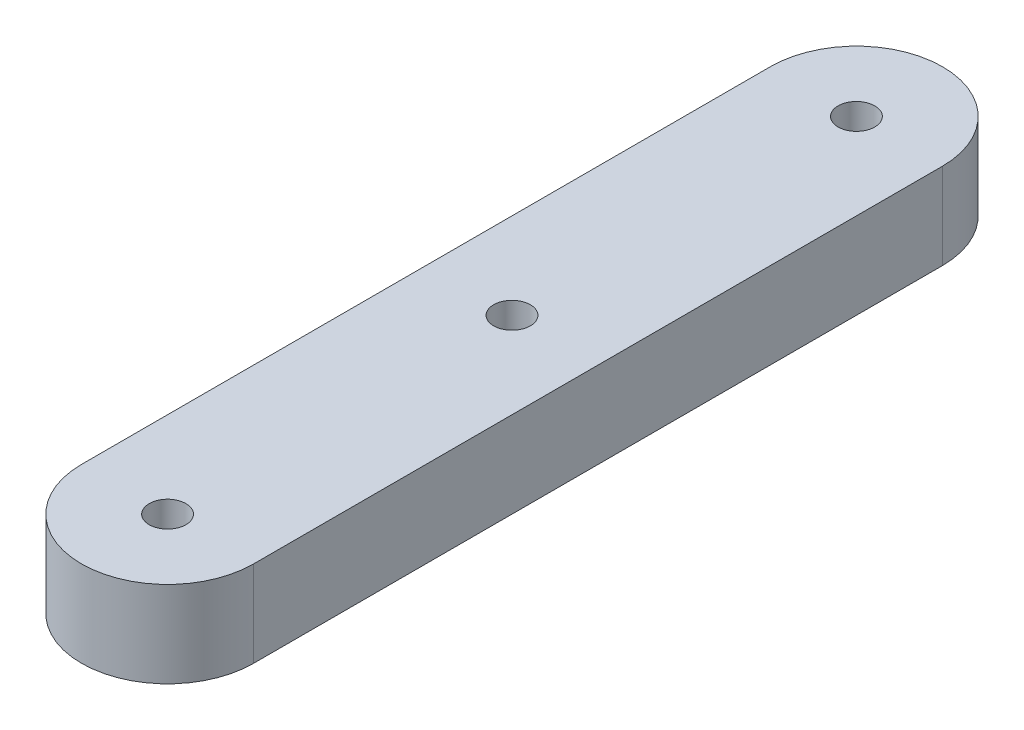
ISO-10303-21;
HEADER;
FILE_DESCRIPTION(('STEP AP214'),'2;1');
FILE_NAME('part.step','',(''),(''),'','','');
FILE_SCHEMA(('AUTOMOTIVE_DESIGN { 1 0 10303 214 1 1 1 1 }'));
ENDSEC;
DATA;
#1=APPLICATION_CONTEXT('core data for automotive mechanical design processes');
#2=APPLICATION_PROTOCOL_DEFINITION('international standard','automotive_design',2000,#1);
#3=PRODUCT_CONTEXT('',#1,'mechanical');
#4=PRODUCT('Part','Part','',(#3));
#5=PRODUCT_RELATED_PRODUCT_CATEGORY('part','',(#4));
#6=PRODUCT_DEFINITION_FORMATION('','',#4);
#7=PRODUCT_DEFINITION_CONTEXT('part definition',#1,'design');
#8=PRODUCT_DEFINITION('design','',#6,#7);
#9=PRODUCT_DEFINITION_SHAPE('','',#8);
#10=(LENGTH_UNIT() NAMED_UNIT(*) SI_UNIT(.MILLI.,.METRE.));
#11=(NAMED_UNIT(*) PLANE_ANGLE_UNIT() SI_UNIT($,.RADIAN.));
#12=(NAMED_UNIT(*) SI_UNIT($,.STERADIAN.) SOLID_ANGLE_UNIT());
#13=UNCERTAINTY_MEASURE_WITH_UNIT(LENGTH_MEASURE(1.E-05),#10,'distance_accuracy_value','');
#14=(GEOMETRIC_REPRESENTATION_CONTEXT(3) GLOBAL_UNCERTAINTY_ASSIGNED_CONTEXT((#13)) GLOBAL_UNIT_ASSIGNED_CONTEXT((#10,
#11,#12)) REPRESENTATION_CONTEXT('',''));
#15=CARTESIAN_POINT('',(0.,0.,0.));
#16=DIRECTION('',(0.,0.,1.));
#17=DIRECTION('',(1.,0.,0.));
#18=AXIS2_PLACEMENT_3D('',#15,#16,#17);
#19=CARTESIAN_POINT('',(0.,6.35,25.4));
#20=DIRECTION('',(0.,-1.,0.));
#21=DIRECTION('',(0.,0.,-1.));
#22=AXIS2_PLACEMENT_3D('',#19,#20,#21);
#23=CYLINDRICAL_SURFACE('',#22,6.35);
#24=CARTESIAN_POINT('',(0.,0.,25.4));
#25=DIRECTION('',(0.,1.,0.));
#26=DIRECTION('',(0.,0.,1.));
#27=AXIS2_PLACEMENT_3D('',#24,#25,#26);
#28=CIRCLE('',#27,6.35);
#29=CARTESIAN_POINT('',(-6.35,0.,25.4));
#30=VERTEX_POINT('',#29);
#31=CARTESIAN_POINT('',(6.35,0.,25.4));
#32=VERTEX_POINT('',#31);
#33=EDGE_CURVE('E98',#30,#32,#28,.T.);
#34=ORIENTED_EDGE('',*,*,#33,.T.);
#35=DIRECTION('',(0.,-1.,0.));
#36=VECTOR('',#35,1.);
#37=CARTESIAN_POINT('',(6.35,6.35,25.4));
#38=LINE('',#37,#36);
#39=CARTESIAN_POINT('',(6.35,6.35,25.4));
#40=VERTEX_POINT('',#39);
#41=EDGE_CURVE('E11',#40,#32,#38,.T.);
#42=ORIENTED_EDGE('',*,*,#41,.F.);
#43=CARTESIAN_POINT('',(0.,6.35,25.4));
#44=DIRECTION('',(0.,1.,0.));
#45=DIRECTION('',(0.,0.,1.));
#46=AXIS2_PLACEMENT_3D('',#43,#44,#45);
#47=CIRCLE('',#46,6.35);
#48=CARTESIAN_POINT('',(-6.35,6.35,25.4));
#49=VERTEX_POINT('',#48);
#50=EDGE_CURVE('E86',#49,#40,#47,.T.);
#51=ORIENTED_EDGE('',*,*,#50,.F.);
#52=DIRECTION('',(0.,-1.,0.));
#53=VECTOR('',#52,1.);
#54=CARTESIAN_POINT('',(-6.35,6.35,25.4));
#55=LINE('',#54,#53);
#56=EDGE_CURVE('E94',#49,#30,#55,.T.);
#57=ORIENTED_EDGE('',*,*,#56,.T.);
#58=EDGE_LOOP('',(#34,#42,#51,#57));
#59=FACE_BOUND('',#58,.T.);
#60=ADVANCED_FACE('F35',(#59),#23,.T.);
#61=CARTESIAN_POINT('',(6.35,6.35,25.4));
#62=DIRECTION('',(-1.,0.,0.));
#63=DIRECTION('',(0.,0.,1.));
#64=AXIS2_PLACEMENT_3D('',#61,#62,#63);
#65=PLANE('',#64);
#66=DIRECTION('',(0.,0.,-1.));
#67=VECTOR('',#66,1.);
#68=CARTESIAN_POINT('',(6.35,0.,25.4));
#69=LINE('',#68,#67);
#70=CARTESIAN_POINT('',(6.34999999999999,0.,-25.4));
#71=VERTEX_POINT('',#70);
#72=EDGE_CURVE('E90',#32,#71,#69,.T.);
#73=ORIENTED_EDGE('',*,*,#72,.T.);
#74=DIRECTION('',(0.,-1.,0.));
#75=VECTOR('',#74,1.);
#76=CARTESIAN_POINT('',(6.34999999999999,6.35,-25.4));
#77=LINE('',#76,#75);
#78=CARTESIAN_POINT('',(6.34999999999999,6.35,-25.4));
#79=VERTEX_POINT('',#78);
#80=EDGE_CURVE('E43',#79,#71,#77,.T.);
#81=ORIENTED_EDGE('',*,*,#80,.F.);
#82=DIRECTION('',(0.,0.,-1.));
#83=VECTOR('',#82,1.);
#84=CARTESIAN_POINT('',(6.35,6.35,25.4));
#85=LINE('',#84,#83);
#86=EDGE_CURVE('E81',#40,#79,#85,.T.);
#87=ORIENTED_EDGE('',*,*,#86,.F.);
#88=ORIENTED_EDGE('',*,*,#41,.T.);
#89=EDGE_LOOP('',(#73,#81,#87,#88));
#90=FACE_BOUND('',#89,.T.);
#91=ADVANCED_FACE('F89',(#90),#65,.F.);
#92=CARTESIAN_POINT('',(0.,6.35,-25.4));
#93=DIRECTION('',(0.,-1.,0.));
#94=DIRECTION('',(0.,0.,-1.));
#95=AXIS2_PLACEMENT_3D('',#92,#93,#94);
#96=CYLINDRICAL_SURFACE('',#95,6.35);
#97=CARTESIAN_POINT('',(0.,0.,-25.4));
#98=DIRECTION('',(0.,1.,0.));
#99=DIRECTION('',(0.,0.,1.));
#100=AXIS2_PLACEMENT_3D('',#97,#98,#99);
#101=CIRCLE('',#100,6.35);
#102=CARTESIAN_POINT('',(-6.35000000000001,0.,-25.4));
#103=VERTEX_POINT('',#102);
#104=EDGE_CURVE('E68',#71,#103,#101,.T.);
#105=ORIENTED_EDGE('',*,*,#104,.T.);
#106=DIRECTION('',(0.,-1.,0.));
#107=VECTOR('',#106,1.);
#108=CARTESIAN_POINT('',(-6.35000000000001,6.35,-25.4));
#109=LINE('',#108,#107);
#110=CARTESIAN_POINT('',(-6.35000000000001,6.35,-25.4));
#111=VERTEX_POINT('',#110);
#112=EDGE_CURVE('E91',#111,#103,#109,.T.);
#113=ORIENTED_EDGE('',*,*,#112,.F.);
#114=CARTESIAN_POINT('',(0.,6.35,-25.4));
#115=DIRECTION('',(0.,1.,0.));
#116=DIRECTION('',(0.,0.,1.));
#117=AXIS2_PLACEMENT_3D('',#114,#115,#116);
#118=CIRCLE('',#117,6.35);
#119=EDGE_CURVE('E84',#79,#111,#118,.T.);
#120=ORIENTED_EDGE('',*,*,#119,.F.);
#121=ORIENTED_EDGE('',*,*,#80,.T.);
#122=EDGE_LOOP('',(#105,#113,#120,#121));
#123=FACE_BOUND('',#122,.T.);
#124=ADVANCED_FACE('F92',(#123),#96,.T.);
#125=CARTESIAN_POINT('',(-6.35,6.35,25.4));
#126=DIRECTION('',(1.,0.,0.));
#127=DIRECTION('',(0.,0.,-1.));
#128=AXIS2_PLACEMENT_3D('',#125,#126,#127);
#129=PLANE('',#128);
#130=DIRECTION('',(0.,0.,1.));
#131=VECTOR('',#130,1.);
#132=CARTESIAN_POINT('',(-6.35,0.,25.4));
#133=LINE('',#132,#131);
#134=EDGE_CURVE('E74',#103,#30,#133,.T.);
#135=ORIENTED_EDGE('',*,*,#134,.T.);
#136=ORIENTED_EDGE('',*,*,#56,.F.);
#137=DIRECTION('',(0.,0.,1.));
#138=VECTOR('',#137,1.);
#139=CARTESIAN_POINT('',(-6.35,6.35,25.4));
#140=LINE('',#139,#138);
#141=EDGE_CURVE('E51',#111,#49,#140,.T.);
#142=ORIENTED_EDGE('',*,*,#141,.F.);
#143=ORIENTED_EDGE('',*,*,#112,.T.);
#144=EDGE_LOOP('',(#135,#136,#142,#143));
#145=FACE_BOUND('',#144,.T.);
#146=ADVANCED_FACE('F106',(#145),#129,.F.);
#147=CARTESIAN_POINT('',(0.,6.35,25.4));
#148=DIRECTION('',(0.,1.,0.));
#149=DIRECTION('',(0.,0.,1.));
#150=AXIS2_PLACEMENT_3D('',#147,#148,#149);
#151=PLANE('',#150);
#152=CARTESIAN_POINT('',(0.,6.35,25.4));
#153=DIRECTION('',(0.,1.,0.));
#154=DIRECTION('',(0.,0.,1.));
#155=AXIS2_PLACEMENT_3D('',#152,#153,#154);
#156=CIRCLE('',#155,1.35255);
#157=CARTESIAN_POINT('',(0.,6.35,26.75255));
#158=VERTEX_POINT('',#157);
#159=EDGE_CURVE('E126',#158,#158,#156,.T.);
#160=ORIENTED_EDGE('',*,*,#159,.F.);
#161=EDGE_LOOP('',(#160));
#162=FACE_BOUND('',#161,.T.);
#163=CARTESIAN_POINT('',(0.,6.35,-25.4));
#164=DIRECTION('',(0.,1.,0.));
#165=DIRECTION('',(0.,0.,1.));
#166=AXIS2_PLACEMENT_3D('',#163,#164,#165);
#167=CIRCLE('',#166,1.35255);
#168=CARTESIAN_POINT('',(0.,6.35,-24.04745));
#169=VERTEX_POINT('',#168);
#170=EDGE_CURVE('E120',#169,#169,#167,.T.);
#171=ORIENTED_EDGE('',*,*,#170,.F.);
#172=EDGE_LOOP('',(#171));
#173=FACE_BOUND('',#172,.T.);
#174=CARTESIAN_POINT('',(0.,6.35,0.));
#175=DIRECTION('',(0.,1.,0.));
#176=DIRECTION('',(0.,0.,1.));
#177=AXIS2_PLACEMENT_3D('',#174,#175,#176);
#178=CIRCLE('',#177,1.35255);
#179=CARTESIAN_POINT('',(0.,6.35,1.35255));
#180=VERTEX_POINT('',#179);
#181=EDGE_CURVE('E114',#180,#180,#178,.T.);
#182=ORIENTED_EDGE('',*,*,#181,.F.);
#183=EDGE_LOOP('',(#182));
#184=FACE_BOUND('',#183,.T.);
#185=ORIENTED_EDGE('',*,*,#50,.T.);
#186=ORIENTED_EDGE('',*,*,#86,.T.);
#187=ORIENTED_EDGE('',*,*,#119,.T.);
#188=ORIENTED_EDGE('',*,*,#141,.T.);
#189=EDGE_LOOP('',(#185,#186,#187,#188));
#190=FACE_BOUND('',#189,.T.);
#191=ADVANCED_FACE('F82',(#162,#173,#184,#190),#151,.T.);
#192=CARTESIAN_POINT('',(0.,0.,25.4));
#193=DIRECTION('',(0.,1.,0.));
#194=DIRECTION('',(0.,0.,1.));
#195=AXIS2_PLACEMENT_3D('',#192,#193,#194);
#196=PLANE('',#195);
#197=CARTESIAN_POINT('',(0.,0.,25.4));
#198=DIRECTION('',(0.,1.,0.));
#199=DIRECTION('',(0.,0.,1.));
#200=AXIS2_PLACEMENT_3D('',#197,#198,#199);
#201=CIRCLE('',#200,1.35255);
#202=CARTESIAN_POINT('',(0.,0.,26.75255));
#203=VERTEX_POINT('',#202);
#204=EDGE_CURVE('E123',#203,#203,#201,.T.);
#205=ORIENTED_EDGE('',*,*,#204,.T.);
#206=EDGE_LOOP('',(#205));
#207=FACE_BOUND('',#206,.T.);
#208=CARTESIAN_POINT('',(0.,0.,-25.4));
#209=DIRECTION('',(0.,1.,0.));
#210=DIRECTION('',(0.,0.,1.));
#211=AXIS2_PLACEMENT_3D('',#208,#209,#210);
#212=CIRCLE('',#211,1.35255);
#213=CARTESIAN_POINT('',(0.,0.,-24.04745));
#214=VERTEX_POINT('',#213);
#215=EDGE_CURVE('E117',#214,#214,#212,.T.);
#216=ORIENTED_EDGE('',*,*,#215,.T.);
#217=EDGE_LOOP('',(#216));
#218=FACE_BOUND('',#217,.T.);
#219=CARTESIAN_POINT('',(0.,0.,0.));
#220=DIRECTION('',(0.,1.,0.));
#221=DIRECTION('',(0.,0.,1.));
#222=AXIS2_PLACEMENT_3D('',#219,#220,#221);
#223=CIRCLE('',#222,1.35255);
#224=CARTESIAN_POINT('',(0.,0.,1.35255));
#225=VERTEX_POINT('',#224);
#226=EDGE_CURVE('E101',#225,#225,#223,.T.);
#227=ORIENTED_EDGE('',*,*,#226,.T.);
#228=EDGE_LOOP('',(#227));
#229=FACE_BOUND('',#228,.T.);
#230=ORIENTED_EDGE('',*,*,#33,.F.);
#231=ORIENTED_EDGE('',*,*,#134,.F.);
#232=ORIENTED_EDGE('',*,*,#104,.F.);
#233=ORIENTED_EDGE('',*,*,#72,.F.);
#234=EDGE_LOOP('',(#230,#231,#232,#233));
#235=FACE_BOUND('',#234,.T.);
#236=ADVANCED_FACE('F109',(#207,#218,#229,#235),#196,.F.);
#237=CARTESIAN_POINT('',(0.,6.35,0.));
#238=DIRECTION('',(0.,1.,0.));
#239=DIRECTION('',(0.,0.,1.));
#240=AXIS2_PLACEMENT_3D('',#237,#238,#239);
#241=CYLINDRICAL_SURFACE('',#240,1.35255);
#242=ORIENTED_EDGE('',*,*,#226,.F.);
#243=EDGE_LOOP('',(#242));
#244=FACE_BOUND('',#243,.T.);
#245=ORIENTED_EDGE('',*,*,#181,.T.);
#246=EDGE_LOOP('',(#245));
#247=FACE_BOUND('',#246,.T.);
#248=ADVANCED_FACE('F139',(#244,#247),#241,.F.);
#249=CARTESIAN_POINT('',(0.,6.35,-25.4));
#250=DIRECTION('',(0.,1.,0.));
#251=DIRECTION('',(0.,0.,1.));
#252=AXIS2_PLACEMENT_3D('',#249,#250,#251);
#253=CYLINDRICAL_SURFACE('',#252,1.35255);
#254=ORIENTED_EDGE('',*,*,#215,.F.);
#255=EDGE_LOOP('',(#254));
#256=FACE_BOUND('',#255,.T.);
#257=ORIENTED_EDGE('',*,*,#170,.T.);
#258=EDGE_LOOP('',(#257));
#259=FACE_BOUND('',#258,.T.);
#260=ADVANCED_FACE('F141',(#256,#259),#253,.F.);
#261=CARTESIAN_POINT('',(0.,6.35,25.4));
#262=DIRECTION('',(0.,1.,0.));
#263=DIRECTION('',(0.,0.,1.));
#264=AXIS2_PLACEMENT_3D('',#261,#262,#263);
#265=CYLINDRICAL_SURFACE('',#264,1.35255);
#266=ORIENTED_EDGE('',*,*,#204,.F.);
#267=EDGE_LOOP('',(#266));
#268=FACE_BOUND('',#267,.T.);
#269=ORIENTED_EDGE('',*,*,#159,.T.);
#270=EDGE_LOOP('',(#269));
#271=FACE_BOUND('',#270,.T.);
#272=ADVANCED_FACE('F130',(#268,#271),#265,.F.);
#273=CLOSED_SHELL('',(#60,#91,#124,#146,#191,#236,#248,#260,#272));
#274=MANIFOLD_SOLID_BREP('B2',#273);
#275=ADVANCED_BREP_SHAPE_REPRESENTATION('',(#18,#274),#14);
#276=SHAPE_DEFINITION_REPRESENTATION(#9,#275);
ENDSEC;
END-ISO-10303-21;
